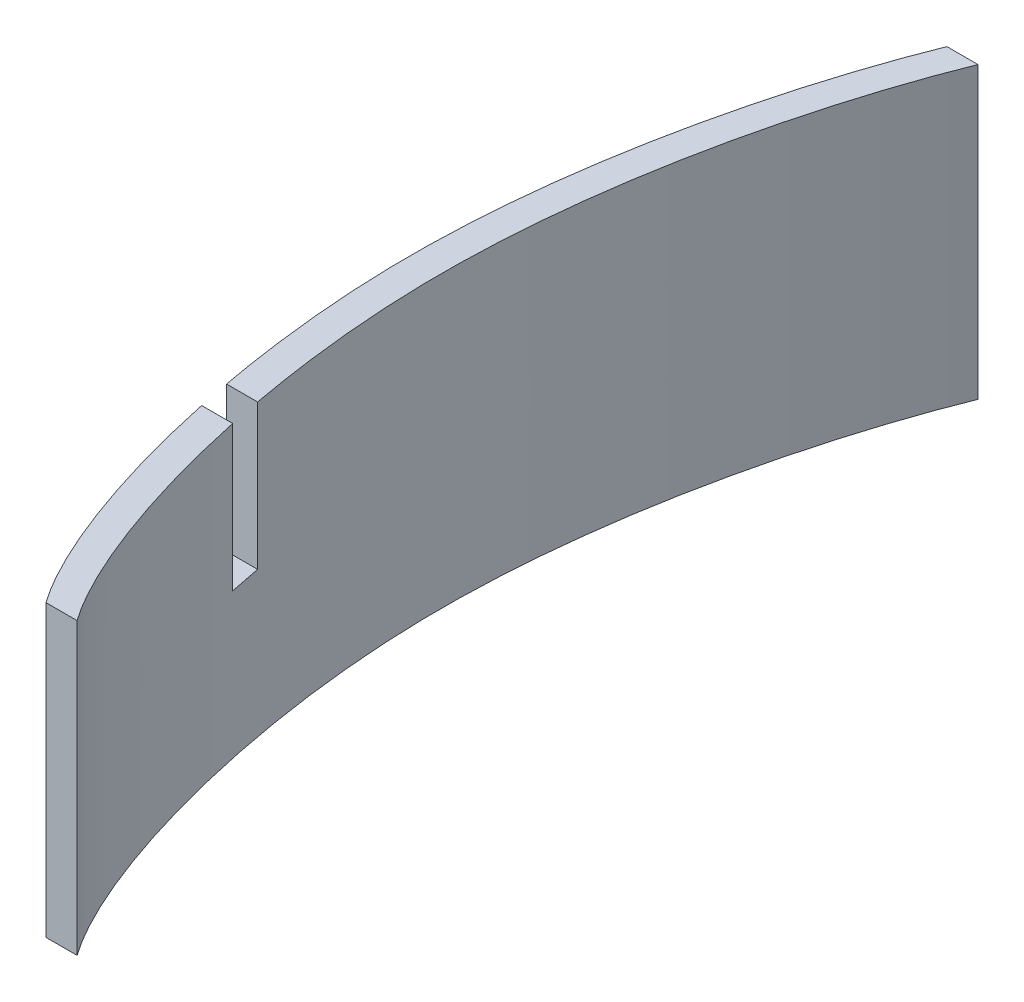
ISO-10303-21;
HEADER;
FILE_DESCRIPTION(('STEP AP214'),'2;1');
FILE_NAME('part.step','',(''),(''),'','','');
FILE_SCHEMA(('AUTOMOTIVE_DESIGN { 1 0 10303 214 1 1 1 1 }'));
ENDSEC;
DATA;
#1=APPLICATION_CONTEXT('core data for automotive mechanical design processes');
#2=APPLICATION_PROTOCOL_DEFINITION('international standard','automotive_design',2000,#1);
#3=PRODUCT_CONTEXT('',#1,'mechanical');
#4=PRODUCT('Part','Part','',(#3));
#5=PRODUCT_RELATED_PRODUCT_CATEGORY('part','',(#4));
#6=PRODUCT_DEFINITION_FORMATION('','',#4);
#7=PRODUCT_DEFINITION_CONTEXT('part definition',#1,'design');
#8=PRODUCT_DEFINITION('design','',#6,#7);
#9=PRODUCT_DEFINITION_SHAPE('','',#8);
#10=(LENGTH_UNIT() NAMED_UNIT(*) SI_UNIT(.MILLI.,.METRE.));
#11=(NAMED_UNIT(*) PLANE_ANGLE_UNIT() SI_UNIT($,.RADIAN.));
#12=(NAMED_UNIT(*) SI_UNIT($,.STERADIAN.) SOLID_ANGLE_UNIT());
#13=UNCERTAINTY_MEASURE_WITH_UNIT(LENGTH_MEASURE(1.E-05),#10,'distance_accuracy_value','');
#14=(GEOMETRIC_REPRESENTATION_CONTEXT(3) GLOBAL_UNCERTAINTY_ASSIGNED_CONTEXT((#13)) GLOBAL_UNIT_ASSIGNED_CONTEXT((#10,
#11,#12)) REPRESENTATION_CONTEXT('',''));
#15=CARTESIAN_POINT('',(0.,0.,0.));
#16=DIRECTION('',(0.,0.,1.));
#17=DIRECTION('',(1.,0.,0.));
#18=AXIS2_PLACEMENT_3D('',#15,#16,#17);
#19=CARTESIAN_POINT('',(-48.7290664504319,0.,571.5));
#20=DIRECTION('',(0.,-1.,0.));
#21=DIRECTION('',(1.,0.,0.));
#22=AXIS2_PLACEMENT_3D('',#19,#20,#21);
#23=PLANE('',#22);
#24=DIRECTION('',(-1.,0.,0.));
#25=VECTOR('',#24,1.);
#26=CARTESIAN_POINT('',(0.578483325075773,0.,800.1));
#27=LINE('',#26,#25);
#28=CARTESIAN_POINT('',(-45.3009926513268,0.,800.1));
#29=VERTEX_POINT('',#28);
#30=CARTESIAN_POINT('',(-83.4322097439353,0.,800.1));
#31=VERTEX_POINT('',#30);
#32=EDGE_CURVE('E230',#29,#31,#27,.T.);
#33=ORIENTED_EDGE('',*,*,#32,.F.);
#34=CARTESIAN_POINT('',(38.1,0.,0.));
#35=CARTESIAN_POINT('',(-10.0467858208071,0.,118.711942806905));
#36=CARTESIAN_POINT('',(-135.555393431846,0.,564.904353861576));
#37=CARTESIAN_POINT('',(5.93276871520138,0.,1043.95619947961));
#38=CARTESIAN_POINT('',(76.2,0.,1143.));
#39=B_SPLINE_CURVE_WITH_KNOTS('',3,(#34,#35,#36,#37,#38),.UNSPECIFIED.,.F.,.F.,(4,1,4),(0.,
0.498249853333726,1.),.UNSPECIFIED.);
#40=CARTESIAN_POINT('',(38.1,0.,0.));
#41=VERTEX_POINT('',#40);
#42=EDGE_CURVE('E136',#41,#29,#39,.T.);
#43=ORIENTED_EDGE('',*,*,#42,.F.);
#44=DIRECTION('',(1.,0.,0.));
#45=VECTOR('',#44,1.);
#46=CARTESIAN_POINT('',(44.7485655108204,0.,0.));
#47=LINE('',#46,#45);
#48=CARTESIAN_POINT('',(0.,0.,0.));
#49=VERTEX_POINT('',#48);
#50=EDGE_CURVE('E205',#49,#41,#47,.T.);
#51=ORIENTED_EDGE('',*,*,#50,.F.);
#52=CARTESIAN_POINT('',(0.,0.,0.));
#53=CARTESIAN_POINT('',(-48.1467858208072,0.,119.037022806313));
#54=CARTESIAN_POINT('',(-173.658132900864,0.,564.418743215032));
#55=CARTESIAN_POINT('',(-32.1617138562553,0.,1044.60458024195));
#56=CARTESIAN_POINT('',(38.1,0.,1143.));
#57=B_SPLINE_CURVE_WITH_KNOTS('',3,(#52,#53,#54,#55,#56),.UNSPECIFIED.,.F.,.F.,(4,1,4),(0.,
0.498249853333726,1.),.UNSPECIFIED.);
#58=EDGE_CURVE('E210',#49,#31,#57,.T.);
#59=ORIENTED_EDGE('',*,*,#58,.T.);
#60=EDGE_LOOP('',(#33,#43,#51,#59));
#61=FACE_BOUND('',#60,.T.);
#62=ADVANCED_FACE('F16',(#61),#23,.F.);
#63=CARTESIAN_POINT('',(0.,-355.6,0.));
#64=CARTESIAN_POINT('',(-48.1467858208072,-355.6,119.037022806313));
#65=CARTESIAN_POINT('',(-173.658132900864,-355.6,564.418743215032));
#66=CARTESIAN_POINT('',(-32.1617138562553,-355.6,1044.60458024195));
#67=CARTESIAN_POINT('',(38.1,-355.6,1143.));
#68=B_SPLINE_CURVE_WITH_KNOTS('',3,(#63,#64,#65,#66,#67),.UNSPECIFIED.,.F.,.F.,(4,1,4),(0.,
0.498249853333726,1.),.UNSPECIFIED.);
#69=DIRECTION('',(0.,1.,0.));
#70=VECTOR('',#69,1.);
#71=SURFACE_OF_LINEAR_EXTRUSION('',#68,#70);
#72=CARTESIAN_POINT('',(0.,-177.8,0.));
#73=CARTESIAN_POINT('',(-48.1467858208072,-177.8,119.037022806313));
#74=CARTESIAN_POINT('',(-173.658132900864,-177.8,564.418743215032));
#75=CARTESIAN_POINT('',(-32.1617138562553,-177.8,1044.60458024195));
#76=CARTESIAN_POINT('',(38.1,-177.8,1143.));
#77=B_SPLINE_CURVE_WITH_KNOTS('',3,(#72,#73,#74,#75,#76),.UNSPECIFIED.,.F.,.F.,(4,1,4),(0.,
0.498249853333726,1.),.UNSPECIFIED.);
#78=CARTESIAN_POINT('',(-83.4322097439353,-177.8,800.1));
#79=VERTEX_POINT('',#78);
#80=CARTESIAN_POINT('',(-75.8663966235822,-177.8,838.19999999026));
#81=VERTEX_POINT('',#80);
#82=EDGE_CURVE('E130',#79,#81,#77,.T.);
#83=ORIENTED_EDGE('',*,*,#82,.F.);
#84=DIRECTION('',(0.,1.,0.));
#85=VECTOR('',#84,1.);
#86=CARTESIAN_POINT('',(-83.4322097439353,-177.8,800.1));
#87=LINE('',#86,#85);
#88=EDGE_CURVE('E128',#79,#31,#87,.T.);
#89=ORIENTED_EDGE('',*,*,#88,.T.);
#90=ORIENTED_EDGE('',*,*,#58,.F.);
#91=DIRECTION('',(0.,1.,0.));
#92=VECTOR('',#91,1.);
#93=CARTESIAN_POINT('',(0.,-355.6,0.));
#94=LINE('',#93,#92);
#95=CARTESIAN_POINT('',(0.,-355.6,0.));
#96=VERTEX_POINT('',#95);
#97=EDGE_CURVE('E10',#96,#49,#94,.T.);
#98=ORIENTED_EDGE('',*,*,#97,.F.);
#99=CARTESIAN_POINT('',(38.1,-355.6,1143.));
#100=VERTEX_POINT('',#99);
#101=EDGE_CURVE('E148',#96,#100,#68,.T.);
#102=ORIENTED_EDGE('',*,*,#101,.T.);
#103=DIRECTION('',(0.,1.,0.));
#104=VECTOR('',#103,1.);
#105=CARTESIAN_POINT('',(38.1,-355.6,1143.));
#106=LINE('',#105,#104);
#107=CARTESIAN_POINT('',(38.1,0.,1143.));
#108=VERTEX_POINT('',#107);
#109=EDGE_CURVE('E51',#100,#108,#106,.T.);
#110=ORIENTED_EDGE('',*,*,#109,.T.);
#111=CARTESIAN_POINT('',(-75.8663966235822,0.,838.19999999026));
#112=VERTEX_POINT('',#111);
#113=EDGE_CURVE('E78',#112,#108,#57,.T.);
#114=ORIENTED_EDGE('',*,*,#113,.F.);
#115=DIRECTION('',(0.,1.,0.));
#116=VECTOR('',#115,1.);
#117=CARTESIAN_POINT('',(-75.8663966235822,-177.8,838.19999999026));
#118=LINE('',#117,#116);
#119=EDGE_CURVE('E145',#81,#112,#118,.T.);
#120=ORIENTED_EDGE('',*,*,#119,.F.);
#121=EDGE_LOOP('',(#83,#89,#90,#98,#102,#110,#114,#120));
#122=FACE_BOUND('',#121,.T.);
#123=ADVANCED_FACE('F18',(#122),#71,.T.);
#124=CARTESIAN_POINT('',(44.7485655108204,-355.6,0.));
#125=DIRECTION('',(0.,0.,1.));
#126=DIRECTION('',(1.,0.,0.));
#127=AXIS2_PLACEMENT_3D('',#124,#125,#126);
#128=PLANE('',#127);
#129=ORIENTED_EDGE('',*,*,#50,.T.);
#130=DIRECTION('',(0.,1.,0.));
#131=VECTOR('',#130,1.);
#132=CARTESIAN_POINT('',(38.1,-355.6,0.));
#133=LINE('',#132,#131);
#134=CARTESIAN_POINT('',(38.1,-355.6,0.));
#135=VERTEX_POINT('',#134);
#136=EDGE_CURVE('E26',#135,#41,#133,.T.);
#137=ORIENTED_EDGE('',*,*,#136,.F.);
#138=DIRECTION('',(1.,0.,0.));
#139=VECTOR('',#138,1.);
#140=CARTESIAN_POINT('',(44.7485655108204,-355.6,0.));
#141=LINE('',#140,#139);
#142=EDGE_CURVE('E154',#96,#135,#141,.T.);
#143=ORIENTED_EDGE('',*,*,#142,.F.);
#144=ORIENTED_EDGE('',*,*,#97,.T.);
#145=EDGE_LOOP('',(#129,#137,#143,#144));
#146=FACE_BOUND('',#145,.T.);
#147=ADVANCED_FACE('F176',(#146),#128,.F.);
#148=CARTESIAN_POINT('',(38.1,-355.6,0.));
#149=CARTESIAN_POINT('',(-10.0467858208071,-355.6,118.711942806905));
#150=CARTESIAN_POINT('',(-135.555393431846,-355.6,564.904353861576));
#151=CARTESIAN_POINT('',(5.93276871520138,-355.6,1043.95619947961));
#152=CARTESIAN_POINT('',(76.2,-355.6,1143.));
#153=B_SPLINE_CURVE_WITH_KNOTS('',3,(#148,#149,#150,#151,#152),.UNSPECIFIED.,.F.,.F.,(4,1,4),
(0.,0.498249853333726,1.),.UNSPECIFIED.);
#154=DIRECTION('',(0.,1.,0.));
#155=VECTOR('',#154,1.);
#156=SURFACE_OF_LINEAR_EXTRUSION('',#153,#155);
#157=CARTESIAN_POINT('',(38.1,-177.8,0.));
#158=CARTESIAN_POINT('',(-10.0467858208071,-177.8,118.711942806905));
#159=CARTESIAN_POINT('',(-135.555393431846,-177.8,564.904353861576));
#160=CARTESIAN_POINT('',(5.93276871520138,-177.8,1043.95619947961));
#161=CARTESIAN_POINT('',(76.2,-177.8,1143.));
#162=B_SPLINE_CURVE_WITH_KNOTS('',3,(#157,#158,#159,#160,#161),.UNSPECIFIED.,.F.,.F.,(4,1,4),
(0.,0.498249853333726,1.),.UNSPECIFIED.);
#163=CARTESIAN_POINT('',(-45.3009926513268,-177.8,800.1));
#164=VERTEX_POINT('',#163);
#165=CARTESIAN_POINT('',(-37.7227908334243,-177.8,838.2));
#166=VERTEX_POINT('',#165);
#167=EDGE_CURVE('E113',#164,#166,#162,.T.);
#168=ORIENTED_EDGE('',*,*,#167,.T.);
#169=DIRECTION('',(0.,1.,0.));
#170=VECTOR('',#169,1.);
#171=CARTESIAN_POINT('',(-37.7227908354966,-177.8,838.199999990261));
#172=LINE('',#171,#170);
#173=CARTESIAN_POINT('',(-37.7227908354966,0.,838.199999990261));
#174=VERTEX_POINT('',#173);
#175=EDGE_CURVE('E138',#166,#174,#172,.T.);
#176=ORIENTED_EDGE('',*,*,#175,.T.);
#177=CARTESIAN_POINT('',(76.2,0.,1143.));
#178=VERTEX_POINT('',#177);
#179=EDGE_CURVE('E200',#174,#178,#39,.T.);
#180=ORIENTED_EDGE('',*,*,#179,.T.);
#181=DIRECTION('',(0.,1.,0.));
#182=VECTOR('',#181,1.);
#183=CARTESIAN_POINT('',(76.2,-355.6,1143.));
#184=LINE('',#183,#182);
#185=CARTESIAN_POINT('',(76.2,-355.6,1143.));
#186=VERTEX_POINT('',#185);
#187=EDGE_CURVE('E222',#186,#178,#184,.T.);
#188=ORIENTED_EDGE('',*,*,#187,.F.);
#189=EDGE_CURVE('E161',#135,#186,#153,.T.);
#190=ORIENTED_EDGE('',*,*,#189,.F.);
#191=ORIENTED_EDGE('',*,*,#136,.T.);
#192=ORIENTED_EDGE('',*,*,#42,.T.);
#193=DIRECTION('',(0.,1.,0.));
#194=VECTOR('',#193,1.);
#195=CARTESIAN_POINT('',(-45.3009926513268,-177.8,800.1));
#196=LINE('',#195,#194);
#197=EDGE_CURVE('E125',#164,#29,#196,.T.);
#198=ORIENTED_EDGE('',*,*,#197,.F.);
#199=EDGE_LOOP('',(#168,#176,#180,#188,#190,#191,#192,#198));
#200=FACE_BOUND('',#199,.T.);
#201=ADVANCED_FACE('F133',(#200),#156,.F.);
#202=CARTESIAN_POINT('',(48.145837356054,-355.6,1143.));
#203=DIRECTION('',(0.,0.,1.));
#204=DIRECTION('',(1.,0.,0.));
#205=AXIS2_PLACEMENT_3D('',#202,#203,#204);
#206=PLANE('',#205);
#207=DIRECTION('',(1.,0.,0.));
#208=VECTOR('',#207,1.);
#209=CARTESIAN_POINT('',(48.145837356054,0.,1143.));
#210=LINE('',#209,#208);
#211=EDGE_CURVE('E155',#108,#178,#210,.T.);
#212=ORIENTED_EDGE('',*,*,#211,.F.);
#213=ORIENTED_EDGE('',*,*,#109,.F.);
#214=DIRECTION('',(1.,0.,0.));
#215=VECTOR('',#214,1.);
#216=CARTESIAN_POINT('',(48.145837356054,-355.6,1143.));
#217=LINE('',#216,#215);
#218=EDGE_CURVE('E167',#100,#186,#217,.T.);
#219=ORIENTED_EDGE('',*,*,#218,.T.);
#220=ORIENTED_EDGE('',*,*,#187,.T.);
#221=EDGE_LOOP('',(#212,#213,#219,#220));
#222=FACE_BOUND('',#221,.T.);
#223=ADVANCED_FACE('F175',(#222),#206,.T.);
#224=CARTESIAN_POINT('',(-48.7290664504319,-355.6,571.5));
#225=DIRECTION('',(0.,-1.,0.));
#226=DIRECTION('',(1.,0.,0.));
#227=AXIS2_PLACEMENT_3D('',#224,#225,#226);
#228=PLANE('',#227);
#229=ORIENTED_EDGE('',*,*,#101,.F.);
#230=ORIENTED_EDGE('',*,*,#142,.T.);
#231=ORIENTED_EDGE('',*,*,#189,.T.);
#232=ORIENTED_EDGE('',*,*,#218,.F.);
#233=EDGE_LOOP('',(#229,#230,#231,#232));
#234=FACE_BOUND('',#233,.T.);
#235=ADVANCED_FACE('F191',(#234),#228,.T.);
#236=ORIENTED_EDGE('',*,*,#179,.F.);
#237=DIRECTION('',(-1.,0.,0.));
#238=VECTOR('',#237,1.);
#239=CARTESIAN_POINT('',(9.22358363799858,0.,838.2));
#240=LINE('',#239,#238);
#241=EDGE_CURVE('E201',#174,#112,#240,.T.);
#242=ORIENTED_EDGE('',*,*,#241,.T.);
#243=ORIENTED_EDGE('',*,*,#113,.T.);
#244=ORIENTED_EDGE('',*,*,#211,.T.);
#245=EDGE_LOOP('',(#236,#242,#243,#244));
#246=FACE_BOUND('',#245,.T.);
#247=ADVANCED_FACE('F186',(#246),#23,.F.);
#248=CARTESIAN_POINT('',(9.22358363799858,-177.8,838.2));
#249=DIRECTION('',(0.,0.,-1.));
#250=DIRECTION('',(-1.,0.,0.));
#251=AXIS2_PLACEMENT_3D('',#248,#249,#250);
#252=PLANE('',#251);
#253=ORIENTED_EDGE('',*,*,#241,.F.);
#254=ORIENTED_EDGE('',*,*,#175,.F.);
#255=DIRECTION('',(-1.,0.,0.));
#256=VECTOR('',#255,1.);
#257=CARTESIAN_POINT('',(9.22358363799858,-177.8,838.2));
#258=LINE('',#257,#256);
#259=EDGE_CURVE('E38',#166,#81,#258,.T.);
#260=ORIENTED_EDGE('',*,*,#259,.T.);
#261=ORIENTED_EDGE('',*,*,#119,.T.);
#262=EDGE_LOOP('',(#253,#254,#260,#261));
#263=FACE_BOUND('',#262,.T.);
#264=ADVANCED_FACE('F190',(#263),#252,.T.);
#265=CARTESIAN_POINT('',(0.578483325075773,-177.8,800.1));
#266=DIRECTION('',(0.,0.,-1.));
#267=DIRECTION('',(-1.,0.,0.));
#268=AXIS2_PLACEMENT_3D('',#265,#266,#267);
#269=PLANE('',#268);
#270=ORIENTED_EDGE('',*,*,#32,.T.);
#271=ORIENTED_EDGE('',*,*,#88,.F.);
#272=DIRECTION('',(-1.,0.,0.));
#273=VECTOR('',#272,1.);
#274=CARTESIAN_POINT('',(0.578483325075773,-177.8,800.1));
#275=LINE('',#274,#273);
#276=EDGE_CURVE('E116',#164,#79,#275,.T.);
#277=ORIENTED_EDGE('',*,*,#276,.F.);
#278=ORIENTED_EDGE('',*,*,#197,.T.);
#279=EDGE_LOOP('',(#270,#271,#277,#278));
#280=FACE_BOUND('',#279,.T.);
#281=ADVANCED_FACE('F124',(#280),#269,.F.);
#282=CARTESIAN_POINT('',(-48.7290664504319,-177.8,571.5));
#283=DIRECTION('',(0.,1.,0.));
#284=DIRECTION('',(-1.,0.,0.));
#285=AXIS2_PLACEMENT_3D('',#282,#283,#284);
#286=PLANE('',#285);
#287=ORIENTED_EDGE('',*,*,#259,.F.);
#288=ORIENTED_EDGE('',*,*,#167,.F.);
#289=ORIENTED_EDGE('',*,*,#276,.T.);
#290=ORIENTED_EDGE('',*,*,#82,.T.);
#291=EDGE_LOOP('',(#287,#288,#289,#290));
#292=FACE_BOUND('',#291,.T.);
#293=ADVANCED_FACE('F115',(#292),#286,.T.);
#294=CLOSED_SHELL('',(#62,#123,#147,#201,#223,#235,#247,#264,#281,#293));
#295=MANIFOLD_SOLID_BREP('B1',#294);
#296=ADVANCED_BREP_SHAPE_REPRESENTATION('',(#18,#295),#14);
#297=SHAPE_DEFINITION_REPRESENTATION(#9,#296);
ENDSEC;
END-ISO-10303-21;
